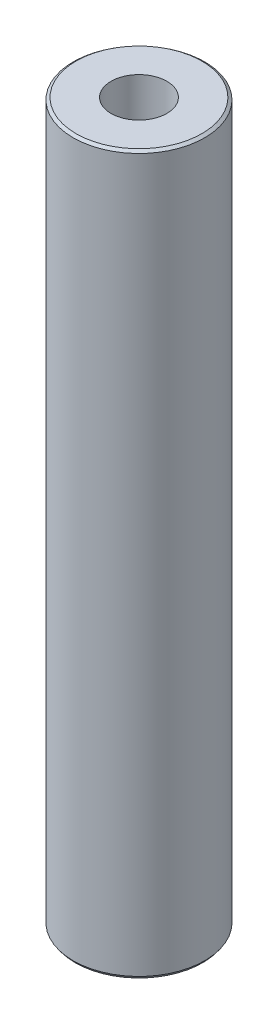
ISO-10303-21;
HEADER;
FILE_DESCRIPTION(('STEP AP214'),'2;1');
FILE_NAME('part.step','',(''),(''),'','','');
FILE_SCHEMA(('AUTOMOTIVE_DESIGN { 1 0 10303 214 1 1 1 1 }'));
ENDSEC;
DATA;
#1=APPLICATION_CONTEXT('core data for automotive mechanical design processes');
#2=APPLICATION_PROTOCOL_DEFINITION('international standard','automotive_design',2000,#1);
#3=PRODUCT_CONTEXT('',#1,'mechanical');
#4=PRODUCT('Part','Part','',(#3));
#5=PRODUCT_RELATED_PRODUCT_CATEGORY('part','',(#4));
#6=PRODUCT_DEFINITION_FORMATION('','',#4);
#7=PRODUCT_DEFINITION_CONTEXT('part definition',#1,'design');
#8=PRODUCT_DEFINITION('design','',#6,#7);
#9=PRODUCT_DEFINITION_SHAPE('','',#8);
#10=(LENGTH_UNIT() NAMED_UNIT(*) SI_UNIT(.MILLI.,.METRE.));
#11=(NAMED_UNIT(*) PLANE_ANGLE_UNIT() SI_UNIT($,.RADIAN.));
#12=(NAMED_UNIT(*) SI_UNIT($,.STERADIAN.) SOLID_ANGLE_UNIT());
#13=UNCERTAINTY_MEASURE_WITH_UNIT(LENGTH_MEASURE(1.E-05),#10,'distance_accuracy_value','');
#14=(GEOMETRIC_REPRESENTATION_CONTEXT(3) GLOBAL_UNCERTAINTY_ASSIGNED_CONTEXT((#13)) GLOBAL_UNIT_ASSIGNED_CONTEXT((#10,
#11,#12)) REPRESENTATION_CONTEXT('',''));
#15=CARTESIAN_POINT('',(0.,0.,0.));
#16=DIRECTION('',(0.,0.,1.));
#17=DIRECTION('',(1.,0.,0.));
#18=AXIS2_PLACEMENT_3D('',#15,#16,#17);
#19=CARTESIAN_POINT('',(0.,600.,0.));
#20=DIRECTION('',(0.,-1.,0.));
#21=DIRECTION('',(0.,0.,-1.));
#22=AXIS2_PLACEMENT_3D('',#19,#20,#21);
#23=CYLINDRICAL_SURFACE('',#22,55.);
#24=CARTESIAN_POINT('',(0.,598.238873517412,0.));
#25=DIRECTION('',(0.,1.,0.));
#26=DIRECTION('',(0.,0.,1.));
#27=AXIS2_PLACEMENT_3D('',#24,#25,#26);
#28=CIRCLE('',#27,55.);
#29=CARTESIAN_POINT('',(0.,598.238873517412,55.));
#30=VERTEX_POINT('',#29);
#31=EDGE_CURVE('E50',#30,#30,#28,.F.);
#32=ORIENTED_EDGE('',*,*,#31,.T.);
#33=EDGE_LOOP('',(#32));
#34=FACE_BOUND('',#33,.T.);
#35=CARTESIAN_POINT('',(0.,2.40230175569811,0.));
#36=DIRECTION('',(0.,1.,0.));
#37=DIRECTION('',(0.,0.,1.));
#38=AXIS2_PLACEMENT_3D('',#35,#36,#37);
#39=CIRCLE('',#38,55.);
#40=CARTESIAN_POINT('',(0.,2.40230175569811,55.));
#41=VERTEX_POINT('',#40);
#42=EDGE_CURVE('E51',#41,#41,#39,.T.);
#43=ORIENTED_EDGE('',*,*,#42,.T.);
#44=EDGE_LOOP('',(#43));
#45=FACE_BOUND('',#44,.T.);
#46=ADVANCED_FACE('F39',(#34,#45),#23,.T.);
#47=CARTESIAN_POINT('',(0.,600.,0.));
#48=DIRECTION('',(0.,1.,0.));
#49=DIRECTION('',(0.,0.,1.));
#50=AXIS2_PLACEMENT_3D('',#47,#48,#49);
#51=PLANE('',#50);
#52=CARTESIAN_POINT('',(0.,600.,0.));
#53=DIRECTION('',(0.,1.,0.));
#54=DIRECTION('',(0.,0.,1.));
#55=AXIS2_PLACEMENT_3D('',#52,#53,#54);
#56=CIRCLE('',#55,52.597698244302);
#57=CARTESIAN_POINT('',(0.,600.,52.597698244302));
#58=VERTEX_POINT('',#57);
#59=EDGE_CURVE('E54',#58,#58,#56,.T.);
#60=ORIENTED_EDGE('',*,*,#59,.T.);
#61=EDGE_LOOP('',(#60));
#62=FACE_BOUND('',#61,.T.);
#63=CARTESIAN_POINT('',(0.,600.,0.));
#64=DIRECTION('',(0.,1.,0.));
#65=DIRECTION('',(0.,0.,1.));
#66=AXIS2_PLACEMENT_3D('',#63,#64,#65);
#67=CIRCLE('',#66,23.3329464931546);
#68=CARTESIAN_POINT('',(0.,600.,23.3329464931546));
#69=VERTEX_POINT('',#68);
#70=EDGE_CURVE('E58',#69,#69,#67,.T.);
#71=ORIENTED_EDGE('',*,*,#70,.F.);
#72=EDGE_LOOP('',(#71));
#73=FACE_BOUND('',#72,.T.);
#74=ADVANCED_FACE('F69',(#62,#73),#51,.T.);
#75=CARTESIAN_POINT('',(0.,0.,0.));
#76=DIRECTION('',(0.,1.,0.));
#77=DIRECTION('',(0.,0.,1.));
#78=AXIS2_PLACEMENT_3D('',#75,#76,#77);
#79=PLANE('',#78);
#80=CARTESIAN_POINT('',(0.,0.,0.));
#81=DIRECTION('',(0.,1.,0.));
#82=DIRECTION('',(0.,0.,1.));
#83=AXIS2_PLACEMENT_3D('',#80,#81,#82);
#84=CIRCLE('',#83,53.2388735174116);
#85=CARTESIAN_POINT('',(0.,0.,53.2388735174116));
#86=VERTEX_POINT('',#85);
#87=EDGE_CURVE('E10',#86,#86,#84,.F.);
#88=ORIENTED_EDGE('',*,*,#87,.T.);
#89=EDGE_LOOP('',(#88));
#90=FACE_BOUND('',#89,.T.);
#91=CARTESIAN_POINT('',(0.,0.,0.));
#92=DIRECTION('',(0.,1.,0.));
#93=DIRECTION('',(0.,0.,1.));
#94=AXIS2_PLACEMENT_3D('',#91,#92,#93);
#95=CIRCLE('',#94,23.3329464931546);
#96=CARTESIAN_POINT('',(0.,0.,23.3329464931546));
#97=VERTEX_POINT('',#96);
#98=EDGE_CURVE('E63',#97,#97,#95,.T.);
#99=ORIENTED_EDGE('',*,*,#98,.T.);
#100=EDGE_LOOP('',(#99));
#101=FACE_BOUND('',#100,.T.);
#102=ADVANCED_FACE('F75',(#90,#101),#79,.F.);
#103=CARTESIAN_POINT('',(0.,600.,0.));
#104=DIRECTION('',(0.,-1.,0.));
#105=DIRECTION('',(0.,0.,-1.));
#106=AXIS2_PLACEMENT_3D('',#103,#104,#105);
#107=CYLINDRICAL_SURFACE('',#106,23.3329464931546);
#108=ORIENTED_EDGE('',*,*,#70,.T.);
#109=EDGE_LOOP('',(#108));
#110=FACE_BOUND('',#109,.T.);
#111=ORIENTED_EDGE('',*,*,#98,.F.);
#112=EDGE_LOOP('',(#111));
#113=FACE_BOUND('',#112,.T.);
#114=ADVANCED_FACE('F70',(#110,#113),#107,.F.);
#115=CARTESIAN_POINT('',(0.,600.,0.));
#116=DIRECTION('',(0.,-1.,0.));
#117=DIRECTION('',(0.,0.,-1.));
#118=AXIS2_PLACEMENT_3D('',#115,#116,#117);
#119=CONICAL_SURFACE('',#118,52.597698244302,0.93819949580496);
#120=ORIENTED_EDGE('',*,*,#31,.F.);
#121=EDGE_LOOP('',(#120));
#122=FACE_BOUND('',#121,.T.);
#123=ORIENTED_EDGE('',*,*,#59,.F.);
#124=EDGE_LOOP('',(#123));
#125=FACE_BOUND('',#124,.T.);
#126=ADVANCED_FACE('F81',(#122,#125),#119,.T.);
#127=CARTESIAN_POINT('',(0.,2.40230175569811,0.));
#128=DIRECTION('',(0.,1.,0.));
#129=DIRECTION('',(0.,0.,1.));
#130=AXIS2_PLACEMENT_3D('',#127,#128,#129);
#131=CONICAL_SURFACE('',#130,55.,0.632596830989938);
#132=CARTESIAN_POINT('',(0.,0.,53.2388735174116));
#133=CARTESIAN_POINT('',(0.,0.0250239766218566,53.2572185849385));
#134=CARTESIAN_POINT('',(0.,0.0500479532437114,53.2755636524655));
#135=CARTESIAN_POINT('',(0.,0.100095906487421,53.3122537875194));
#136=CARTESIAN_POINT('',(0.,0.125119883109276,53.3305988550464));
#137=CARTESIAN_POINT('',(0.,0.175167836352986,53.3672889901003));
#138=CARTESIAN_POINT('',(0.,0.200191812974842,53.3856340576273));
#139=CARTESIAN_POINT('',(0.,0.250239766218554,53.4223241926812));
#140=CARTESIAN_POINT('',(0.,0.275263742840408,53.4406692602082));
#141=CARTESIAN_POINT('',(0.,0.325311696084118,53.4773593952621));
#142=CARTESIAN_POINT('',(0.,0.350335672705973,53.4957044627891));
#143=CARTESIAN_POINT('',(0.,0.400383625949684,53.532394597843));
#144=CARTESIAN_POINT('',(0.,0.425407602571541,53.5507396653699));
#145=CARTESIAN_POINT('',(0.,0.475455555815251,53.5874298004239));
#146=CARTESIAN_POINT('',(0.,0.500479532437105,53.6057748679508));
#147=CARTESIAN_POINT('',(0.,0.550527485680816,53.6424650030048));
#148=CARTESIAN_POINT('',(0.,0.575551462302673,53.6608100705317));
#149=CARTESIAN_POINT('',(0.,0.625599415546383,53.6975002055856));
#150=CARTESIAN_POINT('',(0.,0.650623392168237,53.7158452731126));
#151=CARTESIAN_POINT('',(0.,0.700671345411948,53.7525354081665));
#152=CARTESIAN_POINT('',(0.,0.725695322033804,53.7708804756935));
#153=CARTESIAN_POINT('',(0.,0.775743275277515,53.8075706107474));
#154=CARTESIAN_POINT('',(0.,0.800767251899369,53.8259156782744));
#155=CARTESIAN_POINT('',(0.,0.85081520514308,53.8626058133283));
#156=CARTESIAN_POINT('',(0.,0.875839181764937,53.8809508808553));
#157=CARTESIAN_POINT('',(0.,0.925887135008647,53.9176410159092));
#158=CARTESIAN_POINT('',(0.,0.950911111630501,53.9359860834362));
#159=CARTESIAN_POINT('',(0.,1.00095906487421,53.9726762184901));
#160=CARTESIAN_POINT('',(0.,1.02598304149607,53.9910212860171));
#161=CARTESIAN_POINT('',(0.,1.07603099473978,54.027711421071));
#162=CARTESIAN_POINT('',(0.,1.10105497136163,54.0460564885979));
#163=CARTESIAN_POINT('',(0.,1.15110292460534,54.0827466236519));
#164=CARTESIAN_POINT('',(0.,1.1761269012272,54.1010916911788));
#165=CARTESIAN_POINT('',(0.,1.22617485447091,54.1377818262328));
#166=CARTESIAN_POINT('',(0.,1.25119883109277,54.1561268937597));
#167=CARTESIAN_POINT('',(0.,1.30124678433648,54.1928170288136));
#168=CARTESIAN_POINT('',(0.,1.32627076095833,54.2111620963406));
#169=CARTESIAN_POINT('',(0.,1.37631871420204,54.2478522313945));
#170=CARTESIAN_POINT('',(0.,1.4013426908239,54.2661972989215));
#171=CARTESIAN_POINT('',(0.,1.45139064406761,54.3028874339754));
#172=CARTESIAN_POINT('',(0.,1.47641462068946,54.3212325015024));
#173=CARTESIAN_POINT('',(0.,1.52646257393317,54.3579226365563));
#174=CARTESIAN_POINT('',(0.,1.55148655055503,54.3762677040833));
#175=CARTESIAN_POINT('',(0.,1.60153450379874,54.4129578391372));
#176=CARTESIAN_POINT('',(0.,1.6265584804206,54.4313029066642));
#177=CARTESIAN_POINT('',(0.,1.67660643366431,54.4679930417181));
#178=CARTESIAN_POINT('',(0.,1.70163041028616,54.486338109245));
#179=CARTESIAN_POINT('',(0.,1.75167836352987,54.523028244299));
#180=CARTESIAN_POINT('',(0.,1.77670234015173,54.5413733118259));
#181=CARTESIAN_POINT('',(0.,1.82675029339544,54.5780634468799));
#182=CARTESIAN_POINT('',(0.,1.85177427001729,54.5964085144068));
#183=CARTESIAN_POINT('',(0.,1.901822223261,54.6330986494607));
#184=CARTESIAN_POINT('',(0.,1.92684619988286,54.6514437169877));
#185=CARTESIAN_POINT('',(0.,1.97689415312657,54.6881338520416));
#186=CARTESIAN_POINT('',(0.,2.00191812974843,54.7064789195686));
#187=CARTESIAN_POINT('',(0.,2.05196608299214,54.7431690546225));
#188=CARTESIAN_POINT('',(0.,2.07699005961399,54.7615141221495));
#189=CARTESIAN_POINT('',(0.,2.1270380128577,54.7982042572034));
#190=CARTESIAN_POINT('',(0.,2.15206198947956,54.8165493247304));
#191=CARTESIAN_POINT('',(0.,2.20210994272327,54.8532394597843));
#192=CARTESIAN_POINT('',(0.,2.22713391934512,54.8715845273113));
#193=CARTESIAN_POINT('',(0.,2.27718187258883,54.9082746623652));
#194=CARTESIAN_POINT('',(0.,2.30220584921069,54.9266197298922));
#195=CARTESIAN_POINT('',(0.,2.3522538024544,54.9633098649461));
#196=CARTESIAN_POINT('',(0.,2.37727777907626,54.981654932473));
#197=CARTESIAN_POINT('',(0.,2.40230175569811,55.));
#198=B_SPLINE_CURVE_WITH_KNOTS('',3,(#132,#133,#134,#135,#136,#137,#138,#139,#140,#141,#142,
#143,#144,#145,#146,#147,#148,#149,#150,#151,#152,#153,#154,#155,#156,#157,#158,#159,#160,#161,
#162,#163,#164,#165,#166,#167,#168,#169,#170,#171,#172,#173,#174,#175,#176,#177,#178,#179,#180,
#181,#182,#183,#184,#185,#186,#187,#188,#189,#190,#191,#192,#193,#194,#195,#196,#197),
.UNSPECIFIED.,.F.,.F.,(4,2,2,2,2,2,2,2,2,2,2,2,2,2,2,2,2,2,2,2,2,2,2,2,2,2,2,2,2,2,2,2,4),(0.,
0.0930841993942014,0.186168398788407,0.279252598182608,0.372336797576814,0.46542099697102,
0.558505196365221,0.651589395759426,0.744673595153628,0.837757794547834,0.930841993942035,
1.02392619333624,1.11701039273044,1.21009459212465,1.30317879151885,1.39626299091305,
1.48934719030726,1.58243138970146,1.67551558909567,1.76859978848987,1.86168398788407,
1.95476818727828,2.04785238667248,2.14093658606668,2.23402078546089,2.32710498485509,
2.4201891842493,2.5132733836435,2.6063575830377,2.6994417824319,2.79252598182611,
2.88561018122031,2.97869438061452),.UNSPECIFIED.);
#199=EDGE_CURVE('BSEAM45',#86,#41,#198,.T.);
#200=ORIENTED_EDGE('',*,*,#87,.F.);
#201=ORIENTED_EDGE('',*,*,#42,.F.);
#202=ORIENTED_EDGE('',*,*,#199,.T.);
#203=ORIENTED_EDGE('',*,*,#199,.F.);
#204=EDGE_LOOP('',(#200,#202,#201,#203));
#205=FACE_BOUND('',#204,.T.);
#206=ADVANCED_FACE('F45',(#205),#131,.T.);
#207=CLOSED_SHELL('',(#46,#74,#102,#114,#126,#206));
#208=MANIFOLD_SOLID_BREP('B2',#207);
#209=ADVANCED_BREP_SHAPE_REPRESENTATION('',(#18,#208),#14);
#210=SHAPE_DEFINITION_REPRESENTATION(#9,#209);
ENDSEC;
END-ISO-10303-21;
